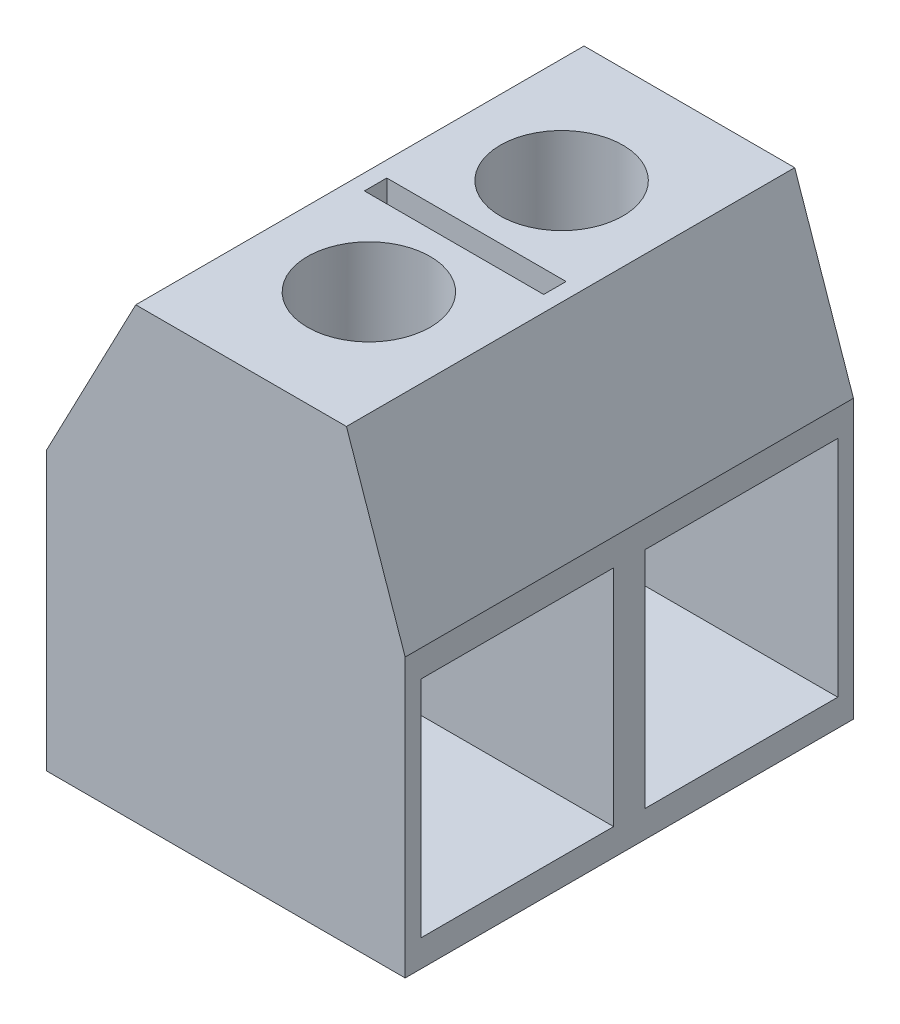
ISO-10303-21;
HEADER;
FILE_DESCRIPTION(('STEP AP214'),'2;1');
FILE_NAME('part.step','',(''),(''),'','','');
FILE_SCHEMA(('AUTOMOTIVE_DESIGN { 1 0 10303 214 1 1 1 1 }'));
ENDSEC;
DATA;
#1=APPLICATION_CONTEXT('core data for automotive mechanical design processes');
#2=APPLICATION_PROTOCOL_DEFINITION('international standard','automotive_design',2000,#1);
#3=PRODUCT_CONTEXT('',#1,'mechanical');
#4=PRODUCT('Part','Part','',(#3));
#5=PRODUCT_RELATED_PRODUCT_CATEGORY('part','',(#4));
#6=PRODUCT_DEFINITION_FORMATION('','',#4);
#7=PRODUCT_DEFINITION_CONTEXT('part definition',#1,'design');
#8=PRODUCT_DEFINITION('design','',#6,#7);
#9=PRODUCT_DEFINITION_SHAPE('','',#8);
#10=(LENGTH_UNIT() NAMED_UNIT(*) SI_UNIT(.MILLI.,.METRE.));
#11=(NAMED_UNIT(*) PLANE_ANGLE_UNIT() SI_UNIT($,.RADIAN.));
#12=(NAMED_UNIT(*) SI_UNIT($,.STERADIAN.) SOLID_ANGLE_UNIT());
#13=UNCERTAINTY_MEASURE_WITH_UNIT(LENGTH_MEASURE(1.E-05),#10,'distance_accuracy_value','');
#14=(GEOMETRIC_REPRESENTATION_CONTEXT(3) GLOBAL_UNCERTAINTY_ASSIGNED_CONTEXT((#13)) GLOBAL_UNIT_ASSIGNED_CONTEXT((#10,
#11,#12)) REPRESENTATION_CONTEXT('',''));
#15=CARTESIAN_POINT('',(0.,0.,0.));
#16=DIRECTION('',(0.,0.,1.));
#17=DIRECTION('',(1.,0.,0.));
#18=AXIS2_PLACEMENT_3D('',#15,#16,#17);
#19=CARTESIAN_POINT('',(-3.41522048364154,6.2,10.));
#20=DIRECTION('',(1.,0.,0.));
#21=DIRECTION('',(0.,1.,0.));
#22=AXIS2_PLACEMENT_3D('',#19,#20,#21);
#23=PLANE('',#22);
#24=DIRECTION('',(0.,-1.,0.));
#25=VECTOR('',#24,1.);
#26=CARTESIAN_POINT('',(-3.41522048364154,6.2,0.));
#27=LINE('',#26,#25);
#28=CARTESIAN_POINT('',(-3.41522048364154,6.2,0.));
#29=VERTEX_POINT('',#28);
#30=CARTESIAN_POINT('',(-3.41522048364153,0.,0.));
#31=VERTEX_POINT('',#30);
#32=EDGE_CURVE('E241',#29,#31,#27,.T.);
#33=ORIENTED_EDGE('',*,*,#32,.T.);
#34=DIRECTION('',(0.,0.,-1.));
#35=VECTOR('',#34,1.);
#36=CARTESIAN_POINT('',(-3.41522048364153,0.,10.));
#37=LINE('',#36,#35);
#38=CARTESIAN_POINT('',(-3.41522048364153,0.,10.));
#39=VERTEX_POINT('',#38);
#40=EDGE_CURVE('E13',#39,#31,#37,.T.);
#41=ORIENTED_EDGE('',*,*,#40,.F.);
#42=DIRECTION('',(0.,-1.,0.));
#43=VECTOR('',#42,1.);
#44=CARTESIAN_POINT('',(-3.41522048364154,6.2,10.));
#45=LINE('',#44,#43);
#46=CARTESIAN_POINT('',(-3.41522048364154,6.2,10.));
#47=VERTEX_POINT('',#46);
#48=EDGE_CURVE('E278',#47,#39,#45,.T.);
#49=ORIENTED_EDGE('',*,*,#48,.F.);
#50=DIRECTION('',(0.,0.,-1.));
#51=VECTOR('',#50,1.);
#52=CARTESIAN_POINT('',(-3.41522048364154,6.2,10.));
#53=LINE('',#52,#51);
#54=EDGE_CURVE('E292',#47,#29,#53,.T.);
#55=ORIENTED_EDGE('',*,*,#54,.T.);
#56=EDGE_LOOP('',(#33,#41,#49,#55));
#57=FACE_BOUND('',#56,.T.);
#58=ADVANCED_FACE('F46',(#57),#23,.F.);
#59=CARTESIAN_POINT('',(-3.41522048364153,0.,10.));
#60=DIRECTION('',(0.,1.,0.));
#61=DIRECTION('',(0.,0.,1.));
#62=AXIS2_PLACEMENT_3D('',#59,#60,#61);
#63=PLANE('',#62);
#64=DIRECTION('',(1.,0.,0.));
#65=VECTOR('',#64,1.);
#66=CARTESIAN_POINT('',(-3.41522048364153,0.,0.));
#67=LINE('',#66,#65);
#68=CARTESIAN_POINT('',(4.58477951635847,0.,0.));
#69=VERTEX_POINT('',#68);
#70=EDGE_CURVE('E295',#31,#69,#67,.T.);
#71=ORIENTED_EDGE('',*,*,#70,.T.);
#72=DIRECTION('',(0.,0.,-1.));
#73=VECTOR('',#72,1.);
#74=CARTESIAN_POINT('',(4.58477951635847,0.,10.));
#75=LINE('',#74,#73);
#76=CARTESIAN_POINT('',(4.58477951635847,0.,10.));
#77=VERTEX_POINT('',#76);
#78=EDGE_CURVE('E54',#77,#69,#75,.T.);
#79=ORIENTED_EDGE('',*,*,#78,.F.);
#80=DIRECTION('',(1.,0.,0.));
#81=VECTOR('',#80,1.);
#82=CARTESIAN_POINT('',(-3.41522048364153,0.,10.));
#83=LINE('',#82,#81);
#84=EDGE_CURVE('E281',#39,#77,#83,.T.);
#85=ORIENTED_EDGE('',*,*,#84,.F.);
#86=ORIENTED_EDGE('',*,*,#40,.T.);
#87=EDGE_LOOP('',(#71,#79,#85,#86));
#88=FACE_BOUND('',#87,.T.);
#89=ADVANCED_FACE('F342',(#88),#63,.F.);
#90=CARTESIAN_POINT('',(4.58477951635847,0.,10.));
#91=DIRECTION('',(-1.,0.,0.));
#92=DIRECTION('',(0.,0.,1.));
#93=AXIS2_PLACEMENT_3D('',#90,#91,#92);
#94=PLANE('',#93);
#95=DIRECTION('',(0.,0.,1.));
#96=VECTOR('',#95,1.);
#97=CARTESIAN_POINT('',(4.58477951635847,5.6,4.65));
#98=LINE('',#97,#96);
#99=CARTESIAN_POINT('',(4.58477951635847,5.6,0.35));
#100=VERTEX_POINT('',#99);
#101=CARTESIAN_POINT('',(4.58477951635847,5.6,4.65));
#102=VERTEX_POINT('',#101);
#103=EDGE_CURVE('E230',#100,#102,#98,.T.);
#104=ORIENTED_EDGE('',*,*,#103,.F.);
#105=DIRECTION('',(0.,1.,0.));
#106=VECTOR('',#105,1.);
#107=CARTESIAN_POINT('',(4.58477951635847,0.599999999999999,0.350000000000001));
#108=LINE('',#107,#106);
#109=CARTESIAN_POINT('',(4.58477951635847,0.599999999999999,0.350000000000001));
#110=VERTEX_POINT('',#109);
#111=EDGE_CURVE('E70',#110,#100,#108,.T.);
#112=ORIENTED_EDGE('',*,*,#111,.F.);
#113=DIRECTION('',(0.,0.,-1.));
#114=VECTOR('',#113,1.);
#115=CARTESIAN_POINT('',(4.58477951635847,0.599999999999999,4.65));
#116=LINE('',#115,#114);
#117=CARTESIAN_POINT('',(4.58477951635847,0.599999999999999,4.65));
#118=VERTEX_POINT('',#117);
#119=EDGE_CURVE('E219',#118,#110,#116,.T.);
#120=ORIENTED_EDGE('',*,*,#119,.F.);
#121=DIRECTION('',(0.,-1.,0.));
#122=VECTOR('',#121,1.);
#123=CARTESIAN_POINT('',(4.58477951635847,0.599999999999999,4.65));
#124=LINE('',#123,#122);
#125=EDGE_CURVE('E234',#102,#118,#124,.T.);
#126=ORIENTED_EDGE('',*,*,#125,.F.);
#127=EDGE_LOOP('',(#104,#112,#120,#126));
#128=FACE_BOUND('',#127,.T.);
#129=DIRECTION('',(0.,0.,1.));
#130=VECTOR('',#129,1.);
#131=CARTESIAN_POINT('',(4.58477951635847,5.6,5.35));
#132=LINE('',#131,#130);
#133=CARTESIAN_POINT('',(4.58477951635847,5.6,5.35));
#134=VERTEX_POINT('',#133);
#135=CARTESIAN_POINT('',(4.58477951635847,5.6,9.65));
#136=VERTEX_POINT('',#135);
#137=EDGE_CURVE('E263',#134,#136,#132,.T.);
#138=ORIENTED_EDGE('',*,*,#137,.F.);
#139=DIRECTION('',(0.,1.,0.));
#140=VECTOR('',#139,1.);
#141=CARTESIAN_POINT('',(4.58477951635847,0.600000000000002,5.35));
#142=LINE('',#141,#140);
#143=CARTESIAN_POINT('',(4.58477951635847,0.600000000000002,5.35));
#144=VERTEX_POINT('',#143);
#145=EDGE_CURVE('E261',#144,#134,#142,.T.);
#146=ORIENTED_EDGE('',*,*,#145,.F.);
#147=DIRECTION('',(0.,0.,-1.));
#148=VECTOR('',#147,1.);
#149=CARTESIAN_POINT('',(4.58477951635847,0.600000000000002,5.35));
#150=LINE('',#149,#148);
#151=CARTESIAN_POINT('',(4.58477951635847,0.600000000000002,9.65));
#152=VERTEX_POINT('',#151);
#153=EDGE_CURVE('E251',#152,#144,#150,.T.);
#154=ORIENTED_EDGE('',*,*,#153,.F.);
#155=DIRECTION('',(0.,-1.,0.));
#156=VECTOR('',#155,1.);
#157=CARTESIAN_POINT('',(4.58477951635847,0.600000000000002,9.65));
#158=LINE('',#157,#156);
#159=EDGE_CURVE('E266',#136,#152,#158,.T.);
#160=ORIENTED_EDGE('',*,*,#159,.F.);
#161=EDGE_LOOP('',(#138,#146,#154,#160));
#162=FACE_BOUND('',#161,.T.);
#163=DIRECTION('',(0.,1.,0.));
#164=VECTOR('',#163,1.);
#165=CARTESIAN_POINT('',(4.58477951635847,0.,0.));
#166=LINE('',#165,#164);
#167=CARTESIAN_POINT('',(4.58477951635847,6.2,0.));
#168=VERTEX_POINT('',#167);
#169=EDGE_CURVE('E297',#69,#168,#166,.T.);
#170=ORIENTED_EDGE('',*,*,#169,.T.);
#171=DIRECTION('',(0.,0.,-1.));
#172=VECTOR('',#171,1.);
#173=CARTESIAN_POINT('',(4.58477951635847,6.2,10.));
#174=LINE('',#173,#172);
#175=CARTESIAN_POINT('',(4.58477951635847,6.2,10.));
#176=VERTEX_POINT('',#175);
#177=EDGE_CURVE('E312',#176,#168,#174,.T.);
#178=ORIENTED_EDGE('',*,*,#177,.F.);
#179=DIRECTION('',(0.,1.,0.));
#180=VECTOR('',#179,1.);
#181=CARTESIAN_POINT('',(4.58477951635847,0.,10.));
#182=LINE('',#181,#180);
#183=EDGE_CURVE('E284',#77,#176,#182,.T.);
#184=ORIENTED_EDGE('',*,*,#183,.F.);
#185=ORIENTED_EDGE('',*,*,#78,.T.);
#186=EDGE_LOOP('',(#170,#178,#184,#185));
#187=FACE_BOUND('',#186,.T.);
#188=ADVANCED_FACE('F347',(#128,#162,#187),#94,.F.);
#189=CARTESIAN_POINT('',(4.58477951635847,6.2,10.));
#190=DIRECTION('',(-0.945410467545081,-0.325881953867028,0.));
#191=DIRECTION('',(0.325881953867028,-0.945410467545081,0.));
#192=AXIS2_PLACEMENT_3D('',#189,#190,#191);
#193=PLANE('',#192);
#194=DIRECTION('',(-0.325881953867028,0.945410467545081,0.));
#195=VECTOR('',#194,1.);
#196=CARTESIAN_POINT('',(4.58477951635847,6.2,0.));
#197=LINE('',#196,#195);
#198=CARTESIAN_POINT('',(3.27473406181301,10.0005500795312,0.));
#199=VERTEX_POINT('',#198);
#200=EDGE_CURVE('E299',#168,#199,#197,.T.);
#201=ORIENTED_EDGE('',*,*,#200,.T.);
#202=DIRECTION('',(0.,0.,-1.));
#203=VECTOR('',#202,1.);
#204=CARTESIAN_POINT('',(3.27473406181301,10.0005500795312,10.));
#205=LINE('',#204,#203);
#206=CARTESIAN_POINT('',(3.27473406181301,10.0005500795312,10.));
#207=VERTEX_POINT('',#206);
#208=EDGE_CURVE('E309',#207,#199,#205,.T.);
#209=ORIENTED_EDGE('',*,*,#208,.F.);
#210=DIRECTION('',(-0.325881953867028,0.945410467545081,0.));
#211=VECTOR('',#210,1.);
#212=CARTESIAN_POINT('',(4.58477951635847,6.2,10.));
#213=LINE('',#212,#211);
#214=EDGE_CURVE('E286',#176,#207,#213,.T.);
#215=ORIENTED_EDGE('',*,*,#214,.F.);
#216=ORIENTED_EDGE('',*,*,#177,.T.);
#217=EDGE_LOOP('',(#201,#209,#215,#216));
#218=FACE_BOUND('',#217,.T.);
#219=ADVANCED_FACE('F372',(#218),#193,.F.);
#220=CARTESIAN_POINT('',(3.27473406181301,10.0005500795312,10.));
#221=DIRECTION('',(0.,-1.,0.));
#222=DIRECTION('',(1.,0.,0.));
#223=AXIS2_PLACEMENT_3D('',#220,#221,#222);
#224=PLANE('',#223);
#225=CARTESIAN_POINT('',(0.924734061813011,10.0005500795312,7.15));
#226=DIRECTION('',(0.,1.,0.));
#227=DIRECTION('',(1.,0.,0.));
#228=AXIS2_PLACEMENT_3D('',#225,#226,#227);
#229=CIRCLE('',#228,1.36868671342724);
#230=CARTESIAN_POINT('',(2.29342077524025,10.0005500795312,7.15));
#231=VERTEX_POINT('',#230);
#232=EDGE_CURVE('E198',#231,#231,#229,.T.);
#233=ORIENTED_EDGE('',*,*,#232,.F.);
#234=EDGE_LOOP('',(#233));
#235=FACE_BOUND('',#234,.T.);
#236=CARTESIAN_POINT('',(0.924734061813011,10.0005500795312,2.85));
#237=DIRECTION('',(0.,1.,0.));
#238=DIRECTION('',(-1.,0.,0.));
#239=AXIS2_PLACEMENT_3D('',#236,#237,#238);
#240=CIRCLE('',#239,1.36868671342724);
#241=CARTESIAN_POINT('',(-0.443952651614231,10.0005500795312,2.85));
#242=VERTEX_POINT('',#241);
#243=EDGE_CURVE('E205',#242,#242,#240,.T.);
#244=ORIENTED_EDGE('',*,*,#243,.F.);
#245=EDGE_LOOP('',(#244));
#246=FACE_BOUND('',#245,.T.);
#247=DIRECTION('',(1.,0.,0.));
#248=VECTOR('',#247,1.);
#249=CARTESIAN_POINT('',(2.92473406181301,10.0005500795312,5.25));
#250=LINE('',#249,#248);
#251=CARTESIAN_POINT('',(-1.07526593818699,10.0005500795312,5.25));
#252=VERTEX_POINT('',#251);
#253=CARTESIAN_POINT('',(2.92473406181301,10.0005500795312,5.25));
#254=VERTEX_POINT('',#253);
#255=EDGE_CURVE('E204',#252,#254,#250,.T.);
#256=ORIENTED_EDGE('',*,*,#255,.F.);
#257=DIRECTION('',(0.,0.,1.));
#258=VECTOR('',#257,1.);
#259=CARTESIAN_POINT('',(-1.07526593818699,10.0005500795312,5.25));
#260=LINE('',#259,#258);
#261=CARTESIAN_POINT('',(-1.07526593818699,10.0005500795312,4.75));
#262=VERTEX_POINT('',#261);
#263=EDGE_CURVE('E62',#262,#252,#260,.T.);
#264=ORIENTED_EDGE('',*,*,#263,.F.);
#265=DIRECTION('',(-1.,0.,0.));
#266=VECTOR('',#265,1.);
#267=CARTESIAN_POINT('',(2.92473406181301,10.0005500795312,4.75));
#268=LINE('',#267,#266);
#269=CARTESIAN_POINT('',(2.92473406181301,10.0005500795312,4.75));
#270=VERTEX_POINT('',#269);
#271=EDGE_CURVE('E192',#270,#262,#268,.T.);
#272=ORIENTED_EDGE('',*,*,#271,.F.);
#273=DIRECTION('',(0.,0.,-1.));
#274=VECTOR('',#273,1.);
#275=CARTESIAN_POINT('',(2.92473406181301,10.0005500795312,5.25));
#276=LINE('',#275,#274);
#277=EDGE_CURVE('E195',#254,#270,#276,.T.);
#278=ORIENTED_EDGE('',*,*,#277,.F.);
#279=EDGE_LOOP('',(#256,#264,#272,#278));
#280=FACE_BOUND('',#279,.T.);
#281=DIRECTION('',(-1.,0.,0.));
#282=VECTOR('',#281,1.);
#283=CARTESIAN_POINT('',(3.27473406181301,10.0005500795312,0.));
#284=LINE('',#283,#282);
#285=CARTESIAN_POINT('',(-1.42526593818699,10.0005500795312,0.));
#286=VERTEX_POINT('',#285);
#287=EDGE_CURVE('E301',#199,#286,#284,.T.);
#288=ORIENTED_EDGE('',*,*,#287,.T.);
#289=DIRECTION('',(0.,0.,-1.));
#290=VECTOR('',#289,1.);
#291=CARTESIAN_POINT('',(-1.42526593818699,10.0005500795312,10.));
#292=LINE('',#291,#290);
#293=CARTESIAN_POINT('',(-1.42526593818699,10.0005500795312,10.));
#294=VERTEX_POINT('',#293);
#295=EDGE_CURVE('E306',#294,#286,#292,.T.);
#296=ORIENTED_EDGE('',*,*,#295,.F.);
#297=DIRECTION('',(-1.,0.,0.));
#298=VECTOR('',#297,1.);
#299=CARTESIAN_POINT('',(3.27473406181301,10.0005500795312,10.));
#300=LINE('',#299,#298);
#301=EDGE_CURVE('E288',#207,#294,#300,.T.);
#302=ORIENTED_EDGE('',*,*,#301,.F.);
#303=ORIENTED_EDGE('',*,*,#208,.T.);
#304=EDGE_LOOP('',(#288,#296,#302,#303));
#305=FACE_BOUND('',#304,.T.);
#306=ADVANCED_FACE('F369',(#235,#246,#280,#305),#224,.F.);
#307=CARTESIAN_POINT('',(-1.42526593818699,10.0005500795312,10.));
#308=DIRECTION('',(0.885909109447838,-0.463858868404323,0.));
#309=DIRECTION('',(0.463858868404323,0.885909109447838,0.));
#310=AXIS2_PLACEMENT_3D('',#307,#308,#309);
#311=PLANE('',#310);
#312=DIRECTION('',(-0.463858868404323,-0.885909109447838,0.));
#313=VECTOR('',#312,1.);
#314=CARTESIAN_POINT('',(-1.42526593818699,10.0005500795312,0.));
#315=LINE('',#314,#313);
#316=EDGE_CURVE('E282',#286,#29,#315,.T.);
#317=ORIENTED_EDGE('',*,*,#316,.T.);
#318=ORIENTED_EDGE('',*,*,#54,.F.);
#319=DIRECTION('',(-0.463858868404323,-0.885909109447838,0.));
#320=VECTOR('',#319,1.);
#321=CARTESIAN_POINT('',(-1.42526593818699,10.0005500795312,10.));
#322=LINE('',#321,#320);
#323=EDGE_CURVE('E290',#294,#47,#322,.T.);
#324=ORIENTED_EDGE('',*,*,#323,.F.);
#325=ORIENTED_EDGE('',*,*,#295,.T.);
#326=EDGE_LOOP('',(#317,#318,#324,#325));
#327=FACE_BOUND('',#326,.T.);
#328=ADVANCED_FACE('F367',(#327),#311,.F.);
#329=CARTESIAN_POINT('',(0.,0.,10.));
#330=DIRECTION('',(0.,0.,1.));
#331=DIRECTION('',(1.,0.,0.));
#332=AXIS2_PLACEMENT_3D('',#329,#330,#331);
#333=PLANE('',#332);
#334=ORIENTED_EDGE('',*,*,#48,.T.);
#335=ORIENTED_EDGE('',*,*,#84,.T.);
#336=ORIENTED_EDGE('',*,*,#183,.T.);
#337=ORIENTED_EDGE('',*,*,#214,.T.);
#338=ORIENTED_EDGE('',*,*,#301,.T.);
#339=ORIENTED_EDGE('',*,*,#323,.T.);
#340=EDGE_LOOP('',(#334,#335,#336,#337,#338,#339));
#341=FACE_BOUND('',#340,.T.);
#342=ADVANCED_FACE('F362',(#341),#333,.T.);
#343=CARTESIAN_POINT('',(0.,0.,0.));
#344=DIRECTION('',(0.,0.,1.));
#345=DIRECTION('',(1.,0.,0.));
#346=AXIS2_PLACEMENT_3D('',#343,#344,#345);
#347=PLANE('',#346);
#348=ORIENTED_EDGE('',*,*,#32,.F.);
#349=ORIENTED_EDGE('',*,*,#316,.F.);
#350=ORIENTED_EDGE('',*,*,#287,.F.);
#351=ORIENTED_EDGE('',*,*,#200,.F.);
#352=ORIENTED_EDGE('',*,*,#169,.F.);
#353=ORIENTED_EDGE('',*,*,#70,.F.);
#354=EDGE_LOOP('',(#348,#349,#350,#351,#352,#353));
#355=FACE_BOUND('',#354,.T.);
#356=ADVANCED_FACE('F355',(#355),#347,.F.);
#357=CARTESIAN_POINT('',(-0.715220483641534,0.600000000000002,5.35));
#358=DIRECTION('',(0.,0.,-1.));
#359=DIRECTION('',(-1.,0.,0.));
#360=AXIS2_PLACEMENT_3D('',#357,#358,#359);
#361=PLANE('',#360);
#362=ORIENTED_EDGE('',*,*,#145,.T.);
#363=DIRECTION('',(1.,0.,0.));
#364=VECTOR('',#363,1.);
#365=CARTESIAN_POINT('',(-0.715220483641534,5.6,5.35));
#366=LINE('',#365,#364);
#367=CARTESIAN_POINT('',(-0.715220483641534,5.6,5.35));
#368=VERTEX_POINT('',#367);
#369=EDGE_CURVE('E260',#368,#134,#366,.T.);
#370=ORIENTED_EDGE('',*,*,#369,.F.);
#371=DIRECTION('',(0.,1.,0.));
#372=VECTOR('',#371,1.);
#373=CARTESIAN_POINT('',(-0.715220483641534,0.600000000000002,5.35));
#374=LINE('',#373,#372);
#375=CARTESIAN_POINT('',(-0.715220483641534,0.600000000000002,5.35));
#376=VERTEX_POINT('',#375);
#377=EDGE_CURVE('E247',#376,#368,#374,.T.);
#378=ORIENTED_EDGE('',*,*,#377,.F.);
#379=DIRECTION('',(1.,0.,0.));
#380=VECTOR('',#379,1.);
#381=CARTESIAN_POINT('',(-0.715220483641534,0.600000000000002,5.35));
#382=LINE('',#381,#380);
#383=EDGE_CURVE('E231',#376,#144,#382,.T.);
#384=ORIENTED_EDGE('',*,*,#383,.T.);
#385=EDGE_LOOP('',(#362,#370,#378,#384));
#386=FACE_BOUND('',#385,.T.);
#387=ADVANCED_FACE('F393',(#386),#361,.F.);
#388=CARTESIAN_POINT('',(-0.715220483641534,0.600000000000002,5.35));
#389=DIRECTION('',(0.,-1.,0.));
#390=DIRECTION('',(0.,0.,-1.));
#391=AXIS2_PLACEMENT_3D('',#388,#389,#390);
#392=PLANE('',#391);
#393=ORIENTED_EDGE('',*,*,#153,.T.);
#394=ORIENTED_EDGE('',*,*,#383,.F.);
#395=DIRECTION('',(0.,0.,-1.));
#396=VECTOR('',#395,1.);
#397=CARTESIAN_POINT('',(-0.715220483641534,0.600000000000002,5.35));
#398=LINE('',#397,#396);
#399=CARTESIAN_POINT('',(-0.715220483641534,0.600000000000002,9.65));
#400=VERTEX_POINT('',#399);
#401=EDGE_CURVE('E257',#400,#376,#398,.T.);
#402=ORIENTED_EDGE('',*,*,#401,.F.);
#403=DIRECTION('',(1.,0.,0.));
#404=VECTOR('',#403,1.);
#405=CARTESIAN_POINT('',(-0.715220483641534,0.600000000000002,9.65));
#406=LINE('',#405,#404);
#407=EDGE_CURVE('E272',#400,#152,#406,.T.);
#408=ORIENTED_EDGE('',*,*,#407,.T.);
#409=EDGE_LOOP('',(#393,#394,#402,#408));
#410=FACE_BOUND('',#409,.T.);
#411=ADVANCED_FACE('F398',(#410),#392,.F.);
#412=CARTESIAN_POINT('',(-0.715220483641534,0.600000000000002,9.65));
#413=DIRECTION('',(0.,0.,1.));
#414=DIRECTION('',(1.,0.,0.));
#415=AXIS2_PLACEMENT_3D('',#412,#413,#414);
#416=PLANE('',#415);
#417=ORIENTED_EDGE('',*,*,#159,.T.);
#418=ORIENTED_EDGE('',*,*,#407,.F.);
#419=DIRECTION('',(0.,-1.,0.));
#420=VECTOR('',#419,1.);
#421=CARTESIAN_POINT('',(-0.715220483641534,0.600000000000002,9.65));
#422=LINE('',#421,#420);
#423=CARTESIAN_POINT('',(-0.715220483641534,5.6,9.65));
#424=VERTEX_POINT('',#423);
#425=EDGE_CURVE('E254',#424,#400,#422,.T.);
#426=ORIENTED_EDGE('',*,*,#425,.F.);
#427=DIRECTION('',(1.,0.,0.));
#428=VECTOR('',#427,1.);
#429=CARTESIAN_POINT('',(-0.715220483641534,5.6,9.65));
#430=LINE('',#429,#428);
#431=EDGE_CURVE('E274',#424,#136,#430,.T.);
#432=ORIENTED_EDGE('',*,*,#431,.T.);
#433=EDGE_LOOP('',(#417,#418,#426,#432));
#434=FACE_BOUND('',#433,.T.);
#435=ADVANCED_FACE('F403',(#434),#416,.F.);
#436=CARTESIAN_POINT('',(-0.715220483641534,5.6,5.35));
#437=DIRECTION('',(0.,1.,0.));
#438=DIRECTION('',(0.,0.,1.));
#439=AXIS2_PLACEMENT_3D('',#436,#437,#438);
#440=PLANE('',#439);
#441=CARTESIAN_POINT('',(0.924734061813015,5.6,7.15));
#442=DIRECTION('',(0.,1.,0.));
#443=DIRECTION('',(0.,0.,1.));
#444=AXIS2_PLACEMENT_3D('',#441,#442,#443);
#445=CIRCLE('',#444,1.36868671342724);
#446=CARTESIAN_POINT('',(0.924734061813015,5.6,8.51868671342724));
#447=VERTEX_POINT('',#446);
#448=EDGE_CURVE('E49',#447,#447,#445,.T.);
#449=ORIENTED_EDGE('',*,*,#448,.T.);
#450=EDGE_LOOP('',(#449));
#451=FACE_BOUND('',#450,.T.);
#452=ORIENTED_EDGE('',*,*,#137,.T.);
#453=ORIENTED_EDGE('',*,*,#431,.F.);
#454=DIRECTION('',(0.,0.,1.));
#455=VECTOR('',#454,1.);
#456=CARTESIAN_POINT('',(-0.715220483641534,5.6,5.35));
#457=LINE('',#456,#455);
#458=EDGE_CURVE('E250',#368,#424,#457,.T.);
#459=ORIENTED_EDGE('',*,*,#458,.F.);
#460=ORIENTED_EDGE('',*,*,#369,.T.);
#461=EDGE_LOOP('',(#452,#453,#459,#460));
#462=FACE_BOUND('',#461,.T.);
#463=ADVANCED_FACE('F322',(#451,#462),#440,.F.);
#464=CARTESIAN_POINT('',(-0.715220483641534,0.,0.));
#465=DIRECTION('',(1.,0.,0.));
#466=DIRECTION('',(0.,0.,-1.));
#467=AXIS2_PLACEMENT_3D('',#464,#465,#466);
#468=PLANE('',#467);
#469=ORIENTED_EDGE('',*,*,#377,.T.);
#470=ORIENTED_EDGE('',*,*,#458,.T.);
#471=ORIENTED_EDGE('',*,*,#425,.T.);
#472=ORIENTED_EDGE('',*,*,#401,.T.);
#473=EDGE_LOOP('',(#469,#470,#471,#472));
#474=FACE_BOUND('',#473,.T.);
#475=ADVANCED_FACE('F402',(#474),#468,.T.);
#476=CARTESIAN_POINT('',(-0.715220483641534,0.599999999999999,0.350000000000001));
#477=DIRECTION('',(0.,0.,-1.));
#478=DIRECTION('',(-1.,0.,0.));
#479=AXIS2_PLACEMENT_3D('',#476,#477,#478);
#480=PLANE('',#479);
#481=ORIENTED_EDGE('',*,*,#111,.T.);
#482=DIRECTION('',(1.,0.,0.));
#483=VECTOR('',#482,1.);
#484=CARTESIAN_POINT('',(-0.715220483641534,5.6,0.350000000000001));
#485=LINE('',#484,#483);
#486=CARTESIAN_POINT('',(-0.715220483641534,5.6,0.350000000000001));
#487=VERTEX_POINT('',#486);
#488=EDGE_CURVE('E228',#487,#100,#485,.T.);
#489=ORIENTED_EDGE('',*,*,#488,.F.);
#490=DIRECTION('',(0.,1.,0.));
#491=VECTOR('',#490,1.);
#492=CARTESIAN_POINT('',(-0.715220483641534,0.599999999999999,0.350000000000001));
#493=LINE('',#492,#491);
#494=CARTESIAN_POINT('',(-0.715220483641534,0.599999999999999,0.350000000000001));
#495=VERTEX_POINT('',#494);
#496=EDGE_CURVE('E215',#495,#487,#493,.T.);
#497=ORIENTED_EDGE('',*,*,#496,.F.);
#498=DIRECTION('',(1.,0.,0.));
#499=VECTOR('',#498,1.);
#500=CARTESIAN_POINT('',(-0.715220483641534,0.599999999999999,0.350000000000001));
#501=LINE('',#500,#499);
#502=EDGE_CURVE('E239',#495,#110,#501,.T.);
#503=ORIENTED_EDGE('',*,*,#502,.T.);
#504=EDGE_LOOP('',(#481,#489,#497,#503));
#505=FACE_BOUND('',#504,.T.);
#506=ADVANCED_FACE('F412',(#505),#480,.F.);
#507=CARTESIAN_POINT('',(-0.715220483641534,0.599999999999999,4.65));
#508=DIRECTION('',(0.,-1.,0.));
#509=DIRECTION('',(0.,0.,-1.));
#510=AXIS2_PLACEMENT_3D('',#507,#508,#509);
#511=PLANE('',#510);
#512=ORIENTED_EDGE('',*,*,#119,.T.);
#513=ORIENTED_EDGE('',*,*,#502,.F.);
#514=DIRECTION('',(0.,0.,-1.));
#515=VECTOR('',#514,1.);
#516=CARTESIAN_POINT('',(-0.715220483641534,0.599999999999999,4.65));
#517=LINE('',#516,#515);
#518=CARTESIAN_POINT('',(-0.715220483641534,0.599999999999999,4.65));
#519=VERTEX_POINT('',#518);
#520=EDGE_CURVE('E225',#519,#495,#517,.T.);
#521=ORIENTED_EDGE('',*,*,#520,.F.);
#522=DIRECTION('',(1.,0.,0.));
#523=VECTOR('',#522,1.);
#524=CARTESIAN_POINT('',(-0.715220483641534,0.599999999999999,4.65));
#525=LINE('',#524,#523);
#526=EDGE_CURVE('E242',#519,#118,#525,.T.);
#527=ORIENTED_EDGE('',*,*,#526,.T.);
#528=EDGE_LOOP('',(#512,#513,#521,#527));
#529=FACE_BOUND('',#528,.T.);
#530=ADVANCED_FACE('F416',(#529),#511,.F.);
#531=CARTESIAN_POINT('',(-0.715220483641534,0.599999999999999,4.65));
#532=DIRECTION('',(0.,0.,1.));
#533=DIRECTION('',(1.,0.,0.));
#534=AXIS2_PLACEMENT_3D('',#531,#532,#533);
#535=PLANE('',#534);
#536=ORIENTED_EDGE('',*,*,#125,.T.);
#537=ORIENTED_EDGE('',*,*,#526,.F.);
#538=DIRECTION('',(0.,-1.,0.));
#539=VECTOR('',#538,1.);
#540=CARTESIAN_POINT('',(-0.715220483641534,0.599999999999999,4.65));
#541=LINE('',#540,#539);
#542=CARTESIAN_POINT('',(-0.715220483641534,5.6,4.65));
#543=VERTEX_POINT('',#542);
#544=EDGE_CURVE('E222',#543,#519,#541,.T.);
#545=ORIENTED_EDGE('',*,*,#544,.F.);
#546=DIRECTION('',(1.,0.,0.));
#547=VECTOR('',#546,1.);
#548=CARTESIAN_POINT('',(-0.715220483641534,5.6,4.65));
#549=LINE('',#548,#547);
#550=EDGE_CURVE('E244',#543,#102,#549,.T.);
#551=ORIENTED_EDGE('',*,*,#550,.T.);
#552=EDGE_LOOP('',(#536,#537,#545,#551));
#553=FACE_BOUND('',#552,.T.);
#554=ADVANCED_FACE('F420',(#553),#535,.F.);
#555=CARTESIAN_POINT('',(-0.715220483641534,5.6,4.65));
#556=DIRECTION('',(0.,1.,0.));
#557=DIRECTION('',(0.,0.,1.));
#558=AXIS2_PLACEMENT_3D('',#555,#556,#557);
#559=PLANE('',#558);
#560=CARTESIAN_POINT('',(0.924734061813015,5.6,2.85));
#561=DIRECTION('',(0.,1.,0.));
#562=DIRECTION('',(0.,0.,1.));
#563=AXIS2_PLACEMENT_3D('',#560,#561,#562);
#564=CIRCLE('',#563,1.36868671342724);
#565=CARTESIAN_POINT('',(0.924734061813015,5.6,4.21868671342724));
#566=VERTEX_POINT('',#565);
#567=EDGE_CURVE('E211',#566,#566,#564,.T.);
#568=ORIENTED_EDGE('',*,*,#567,.T.);
#569=EDGE_LOOP('',(#568));
#570=FACE_BOUND('',#569,.T.);
#571=ORIENTED_EDGE('',*,*,#103,.T.);
#572=ORIENTED_EDGE('',*,*,#550,.F.);
#573=DIRECTION('',(0.,0.,1.));
#574=VECTOR('',#573,1.);
#575=CARTESIAN_POINT('',(-0.715220483641534,5.6,4.65));
#576=LINE('',#575,#574);
#577=EDGE_CURVE('E218',#487,#543,#576,.T.);
#578=ORIENTED_EDGE('',*,*,#577,.F.);
#579=ORIENTED_EDGE('',*,*,#488,.T.);
#580=EDGE_LOOP('',(#571,#572,#578,#579));
#581=FACE_BOUND('',#580,.T.);
#582=ADVANCED_FACE('F417',(#570,#581),#559,.F.);
#583=CARTESIAN_POINT('',(-0.715220483641534,0.,0.));
#584=DIRECTION('',(-1.,0.,0.));
#585=DIRECTION('',(0.,0.,1.));
#586=AXIS2_PLACEMENT_3D('',#583,#584,#585);
#587=PLANE('',#586);
#588=ORIENTED_EDGE('',*,*,#496,.T.);
#589=ORIENTED_EDGE('',*,*,#577,.T.);
#590=ORIENTED_EDGE('',*,*,#544,.T.);
#591=ORIENTED_EDGE('',*,*,#520,.T.);
#592=EDGE_LOOP('',(#588,#589,#590,#591));
#593=FACE_BOUND('',#592,.T.);
#594=ADVANCED_FACE('F336',(#593),#587,.F.);
#595=CARTESIAN_POINT('',(0.924734061813015,5.00055007953122,2.85));
#596=DIRECTION('',(0.,1.,0.));
#597=DIRECTION('',(-1.,0.,0.));
#598=AXIS2_PLACEMENT_3D('',#595,#596,#597);
#599=CYLINDRICAL_SURFACE('',#598,1.36868671342724);
#600=ORIENTED_EDGE('',*,*,#243,.T.);
#601=EDGE_LOOP('',(#600));
#602=FACE_BOUND('',#601,.T.);
#603=ORIENTED_EDGE('',*,*,#567,.F.);
#604=EDGE_LOOP('',(#603));
#605=FACE_BOUND('',#604,.T.);
#606=ADVANCED_FACE('F327',(#602,#605),#599,.F.);
#607=CARTESIAN_POINT('',(0.924734061813015,5.00055007953122,7.15));
#608=DIRECTION('',(0.,1.,0.));
#609=DIRECTION('',(-1.,0.,0.));
#610=AXIS2_PLACEMENT_3D('',#607,#608,#609);
#611=CYLINDRICAL_SURFACE('',#610,1.36868671342724);
#612=ORIENTED_EDGE('',*,*,#232,.T.);
#613=EDGE_LOOP('',(#612));
#614=FACE_BOUND('',#613,.T.);
#615=ORIENTED_EDGE('',*,*,#448,.F.);
#616=EDGE_LOOP('',(#615));
#617=FACE_BOUND('',#616,.T.);
#618=ADVANCED_FACE('F325',(#614,#617),#611,.F.);
#619=CARTESIAN_POINT('',(-1.07526593818699,5.00055007953122,5.25));
#620=DIRECTION('',(-1.,0.,0.));
#621=DIRECTION('',(0.,-1.,0.));
#622=AXIS2_PLACEMENT_3D('',#619,#620,#621);
#623=PLANE('',#622);
#624=ORIENTED_EDGE('',*,*,#263,.T.);
#625=DIRECTION('',(0.,1.,0.));
#626=VECTOR('',#625,1.);
#627=CARTESIAN_POINT('',(-1.07526593818699,5.00055007953122,5.25));
#628=LINE('',#627,#626);
#629=CARTESIAN_POINT('',(-1.07526593818699,5.00055007953122,5.25));
#630=VERTEX_POINT('',#629);
#631=EDGE_CURVE('E170',#630,#252,#628,.T.);
#632=ORIENTED_EDGE('',*,*,#631,.F.);
#633=DIRECTION('',(0.,0.,1.));
#634=VECTOR('',#633,1.);
#635=CARTESIAN_POINT('',(-1.07526593818699,5.00055007953122,5.25));
#636=LINE('',#635,#634);
#637=CARTESIAN_POINT('',(-1.07526593818699,5.00055007953122,4.75));
#638=VERTEX_POINT('',#637);
#639=EDGE_CURVE('E174',#638,#630,#636,.T.);
#640=ORIENTED_EDGE('',*,*,#639,.F.);
#641=DIRECTION('',(0.,1.,0.));
#642=VECTOR('',#641,1.);
#643=CARTESIAN_POINT('',(-1.07526593818699,5.00055007953122,4.75));
#644=LINE('',#643,#642);
#645=EDGE_CURVE('E209',#638,#262,#644,.T.);
#646=ORIENTED_EDGE('',*,*,#645,.T.);
#647=EDGE_LOOP('',(#624,#632,#640,#646));
#648=FACE_BOUND('',#647,.T.);
#649=ADVANCED_FACE('F172',(#648),#623,.F.);
#650=CARTESIAN_POINT('',(2.92473406181301,5.00055007953123,4.75));
#651=DIRECTION('',(0.,0.,-1.));
#652=DIRECTION('',(-1.,0.,0.));
#653=AXIS2_PLACEMENT_3D('',#650,#651,#652);
#654=PLANE('',#653);
#655=ORIENTED_EDGE('',*,*,#271,.T.);
#656=ORIENTED_EDGE('',*,*,#645,.F.);
#657=DIRECTION('',(-1.,0.,0.));
#658=VECTOR('',#657,1.);
#659=CARTESIAN_POINT('',(2.92473406181301,5.00055007953123,4.75));
#660=LINE('',#659,#658);
#661=CARTESIAN_POINT('',(2.92473406181301,5.00055007953123,4.75));
#662=VERTEX_POINT('',#661);
#663=EDGE_CURVE('E180',#662,#638,#660,.T.);
#664=ORIENTED_EDGE('',*,*,#663,.F.);
#665=DIRECTION('',(0.,1.,0.));
#666=VECTOR('',#665,1.);
#667=CARTESIAN_POINT('',(2.92473406181301,5.00055007953123,4.75));
#668=LINE('',#667,#666);
#669=EDGE_CURVE('E212',#662,#270,#668,.T.);
#670=ORIENTED_EDGE('',*,*,#669,.T.);
#671=EDGE_LOOP('',(#655,#656,#664,#670));
#672=FACE_BOUND('',#671,.T.);
#673=ADVANCED_FACE('F334',(#672),#654,.F.);
#674=CARTESIAN_POINT('',(2.92473406181301,5.00055007953123,5.25));
#675=DIRECTION('',(1.,0.,0.));
#676=DIRECTION('',(0.,1.,0.));
#677=AXIS2_PLACEMENT_3D('',#674,#675,#676);
#678=PLANE('',#677);
#679=ORIENTED_EDGE('',*,*,#277,.T.);
#680=ORIENTED_EDGE('',*,*,#669,.F.);
#681=DIRECTION('',(0.,0.,-1.));
#682=VECTOR('',#681,1.);
#683=CARTESIAN_POINT('',(2.92473406181301,5.00055007953123,5.25));
#684=LINE('',#683,#682);
#685=CARTESIAN_POINT('',(2.92473406181301,5.00055007953123,5.25));
#686=VERTEX_POINT('',#685);
#687=EDGE_CURVE('E188',#686,#662,#684,.T.);
#688=ORIENTED_EDGE('',*,*,#687,.F.);
#689=DIRECTION('',(0.,1.,0.));
#690=VECTOR('',#689,1.);
#691=CARTESIAN_POINT('',(2.92473406181301,5.00055007953123,5.25));
#692=LINE('',#691,#690);
#693=EDGE_CURVE('E179',#686,#254,#692,.T.);
#694=ORIENTED_EDGE('',*,*,#693,.T.);
#695=EDGE_LOOP('',(#679,#680,#688,#694));
#696=FACE_BOUND('',#695,.T.);
#697=ADVANCED_FACE('F432',(#696),#678,.F.);
#698=CARTESIAN_POINT('',(2.92473406181301,5.00055007953123,5.25));
#699=DIRECTION('',(0.,0.,1.));
#700=DIRECTION('',(1.,0.,0.));
#701=AXIS2_PLACEMENT_3D('',#698,#699,#700);
#702=PLANE('',#701);
#703=ORIENTED_EDGE('',*,*,#255,.T.);
#704=ORIENTED_EDGE('',*,*,#693,.F.);
#705=DIRECTION('',(1.,0.,0.));
#706=VECTOR('',#705,1.);
#707=CARTESIAN_POINT('',(2.92473406181301,5.00055007953123,5.25));
#708=LINE('',#707,#706);
#709=EDGE_CURVE('E183',#630,#686,#708,.T.);
#710=ORIENTED_EDGE('',*,*,#709,.F.);
#711=ORIENTED_EDGE('',*,*,#631,.T.);
#712=EDGE_LOOP('',(#703,#704,#710,#711));
#713=FACE_BOUND('',#712,.T.);
#714=ADVANCED_FACE('F184',(#713),#702,.F.);
#715=CARTESIAN_POINT('',(0.,5.00055007953122,0.));
#716=DIRECTION('',(0.,1.,0.));
#717=DIRECTION('',(-1.,0.,0.));
#718=AXIS2_PLACEMENT_3D('',#715,#716,#717);
#719=PLANE('',#718);
#720=ORIENTED_EDGE('',*,*,#639,.T.);
#721=ORIENTED_EDGE('',*,*,#709,.T.);
#722=ORIENTED_EDGE('',*,*,#687,.T.);
#723=ORIENTED_EDGE('',*,*,#663,.T.);
#724=EDGE_LOOP('',(#720,#721,#722,#723));
#725=FACE_BOUND('',#724,.T.);
#726=ADVANCED_FACE('F190',(#725),#719,.T.);
#727=CLOSED_SHELL('',(#58,#89,#188,#219,#306,#328,#342,#356,#387,#411,#435,#463,#475,#506,#530,
#554,#582,#594,#606,#618,#649,#673,#697,#714,#726));
#728=MANIFOLD_SOLID_BREP('B2',#727);
#729=ADVANCED_BREP_SHAPE_REPRESENTATION('',(#18,#728),#14);
#730=SHAPE_DEFINITION_REPRESENTATION(#9,#729);
ENDSEC;
END-ISO-10303-21;
